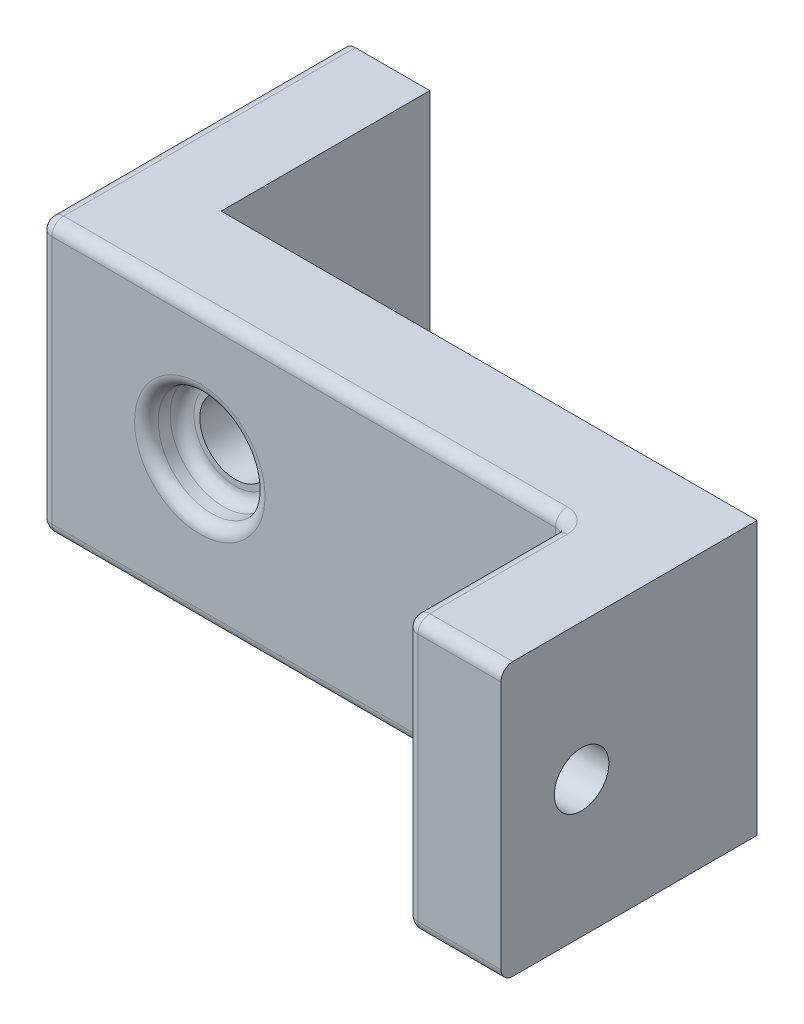
ISO-10303-21;
HEADER;
FILE_DESCRIPTION(('STEP AP214'),'2;1');
FILE_NAME('part.step','',(''),(''),'','','');
FILE_SCHEMA(('AUTOMOTIVE_DESIGN { 1 0 10303 214 1 1 1 1 }'));
ENDSEC;
DATA;
#1=APPLICATION_CONTEXT('core data for automotive mechanical design processes');
#2=APPLICATION_PROTOCOL_DEFINITION('international standard','automotive_design',2000,#1);
#3=PRODUCT_CONTEXT('',#1,'mechanical');
#4=PRODUCT('Part','Part','',(#3));
#5=PRODUCT_RELATED_PRODUCT_CATEGORY('part','',(#4));
#6=PRODUCT_DEFINITION_FORMATION('','',#4);
#7=PRODUCT_DEFINITION_CONTEXT('part definition',#1,'design');
#8=PRODUCT_DEFINITION('design','',#6,#7);
#9=PRODUCT_DEFINITION_SHAPE('','',#8);
#10=(LENGTH_UNIT() NAMED_UNIT(*) SI_UNIT(.MILLI.,.METRE.));
#11=(NAMED_UNIT(*) PLANE_ANGLE_UNIT() SI_UNIT($,.RADIAN.));
#12=(NAMED_UNIT(*) SI_UNIT($,.STERADIAN.) SOLID_ANGLE_UNIT());
#13=UNCERTAINTY_MEASURE_WITH_UNIT(LENGTH_MEASURE(1.E-05),#10,'distance_accuracy_value','');
#14=(GEOMETRIC_REPRESENTATION_CONTEXT(3) GLOBAL_UNCERTAINTY_ASSIGNED_CONTEXT((#13)) GLOBAL_UNIT_ASSIGNED_CONTEXT((#10,
#11,#12)) REPRESENTATION_CONTEXT('',''));
#15=CARTESIAN_POINT('',(0.,0.,0.));
#16=DIRECTION('',(0.,0.,1.));
#17=DIRECTION('',(1.,0.,0.));
#18=AXIS2_PLACEMENT_3D('',#15,#16,#17);
#19=CARTESIAN_POINT('',(6.74,6.,-4.5));
#20=DIRECTION('',(0.,0.,1.));
#21=DIRECTION('',(1.,0.,0.));
#22=AXIS2_PLACEMENT_3D('',#19,#20,#21);
#23=CYLINDRICAL_SURFACE('',#22,1.5);
#24=CARTESIAN_POINT('',(6.74,6.,-4.));
#25=DIRECTION('',(0.,0.,1.));
#26=DIRECTION('',(1.,0.,0.));
#27=AXIS2_PLACEMENT_3D('',#24,#25,#26);
#28=CIRCLE('',#27,1.5);
#29=CARTESIAN_POINT('',(8.24000000000001,6.,-4.));
#30=VERTEX_POINT('',#29);
#31=EDGE_CURVE('E193',#30,#30,#28,.T.);
#32=ORIENTED_EDGE('',*,*,#31,.F.);
#33=EDGE_LOOP('',(#32));
#34=FACE_BOUND('',#33,.T.);
#35=CARTESIAN_POINT('',(6.74,6.,-1.5));
#36=DIRECTION('',(0.,0.,1.));
#37=DIRECTION('',(1.,0.,0.));
#38=AXIS2_PLACEMENT_3D('',#35,#36,#37);
#39=CIRCLE('',#38,1.5);
#40=CARTESIAN_POINT('',(8.24000000000001,6.,-1.5));
#41=VERTEX_POINT('',#40);
#42=EDGE_CURVE('E209',#41,#41,#39,.F.);
#43=ORIENTED_EDGE('',*,*,#42,.F.);
#44=EDGE_LOOP('',(#43));
#45=FACE_BOUND('',#44,.T.);
#46=ADVANCED_FACE('F35',(#34,#45),#23,.F.);
#47=CARTESIAN_POINT('',(22.24,11.5,0.));
#48=DIRECTION('',(0.,0.,-1.));
#49=DIRECTION('',(-1.,0.,0.));
#50=AXIS2_PLACEMENT_3D('',#47,#48,#49);
#51=PLANE('',#50);
#52=DIRECTION('',(0.,-1.,0.));
#53=VECTOR('',#52,1.);
#54=CARTESIAN_POINT('',(0.5,11.5,0.));
#55=LINE('',#54,#53);
#56=CARTESIAN_POINT('',(0.5,11.,0.));
#57=VERTEX_POINT('',#56);
#58=CARTESIAN_POINT('',(0.5,0.5,0.));
#59=VERTEX_POINT('',#58);
#60=EDGE_CURVE('E44',#57,#59,#55,.T.);
#61=ORIENTED_EDGE('',*,*,#60,.T.);
#62=DIRECTION('',(1.,0.,0.));
#63=VECTOR('',#62,1.);
#64=CARTESIAN_POINT('',(22.24,0.5,0.));
#65=LINE('',#64,#63);
#66=CARTESIAN_POINT('',(21.74,0.5,0.));
#67=VERTEX_POINT('',#66);
#68=EDGE_CURVE('E11',#59,#67,#65,.T.);
#69=ORIENTED_EDGE('',*,*,#68,.T.);
#70=DIRECTION('',(0.,-1.,0.));
#71=VECTOR('',#70,1.);
#72=CARTESIAN_POINT('',(21.74,11.5,0.));
#73=LINE('',#72,#71);
#74=CARTESIAN_POINT('',(21.74,11.,0.));
#75=VERTEX_POINT('',#74);
#76=EDGE_CURVE('E289',#67,#75,#73,.F.);
#77=ORIENTED_EDGE('',*,*,#76,.T.);
#78=DIRECTION('',(1.,0.,0.));
#79=VECTOR('',#78,1.);
#80=CARTESIAN_POINT('',(22.24,11.,0.));
#81=LINE('',#80,#79);
#82=EDGE_CURVE('E287',#75,#57,#81,.F.);
#83=ORIENTED_EDGE('',*,*,#82,.T.);
#84=EDGE_LOOP('',(#61,#69,#77,#83));
#85=FACE_BOUND('',#84,.T.);
#86=CARTESIAN_POINT('',(6.74,6.,0.));
#87=DIRECTION('',(0.,0.,-1.));
#88=DIRECTION('',(-1.,0.,0.));
#89=AXIS2_PLACEMENT_3D('',#86,#87,#88);
#90=CIRCLE('',#89,2.75);
#91=CARTESIAN_POINT('',(3.99,6.,0.));
#92=VERTEX_POINT('',#91);
#93=EDGE_CURVE('E221',#92,#92,#90,.T.);
#94=ORIENTED_EDGE('',*,*,#93,.T.);
#95=EDGE_LOOP('',(#94));
#96=FACE_BOUND('',#95,.T.);
#97=ADVANCED_FACE('F368',(#85,#96),#51,.F.);
#98=CARTESIAN_POINT('',(22.24,11.5,6.8));
#99=DIRECTION('',(1.,0.,0.));
#100=DIRECTION('',(0.,0.,-1.));
#101=AXIS2_PLACEMENT_3D('',#98,#99,#100);
#102=PLANE('',#101);
#103=DIRECTION('',(0.,-1.,0.));
#104=VECTOR('',#103,1.);
#105=CARTESIAN_POINT('',(22.24,0.,0.5));
#106=LINE('',#105,#104);
#107=CARTESIAN_POINT('',(22.24,11.,0.5));
#108=VERTEX_POINT('',#107);
#109=CARTESIAN_POINT('',(22.24,0.5,0.5));
#110=VERTEX_POINT('',#109);
#111=EDGE_CURVE('E240',#108,#110,#106,.T.);
#112=ORIENTED_EDGE('',*,*,#111,.T.);
#113=DIRECTION('',(0.,0.,1.));
#114=VECTOR('',#113,1.);
#115=CARTESIAN_POINT('',(22.24,0.5,6.8));
#116=LINE('',#115,#114);
#117=CARTESIAN_POINT('',(22.24,0.5,6.3));
#118=VERTEX_POINT('',#117);
#119=EDGE_CURVE('E242',#110,#118,#116,.T.);
#120=ORIENTED_EDGE('',*,*,#119,.T.);
#121=DIRECTION('',(0.,-1.,0.));
#122=VECTOR('',#121,1.);
#123=CARTESIAN_POINT('',(22.24,11.5,6.3));
#124=LINE('',#123,#122);
#125=CARTESIAN_POINT('',(22.24,11.,6.3));
#126=VERTEX_POINT('',#125);
#127=EDGE_CURVE('E238',#118,#126,#124,.F.);
#128=ORIENTED_EDGE('',*,*,#127,.T.);
#129=DIRECTION('',(0.,0.,1.));
#130=VECTOR('',#129,1.);
#131=CARTESIAN_POINT('',(22.24,11.,6.8));
#132=LINE('',#131,#130);
#133=EDGE_CURVE('E236',#126,#108,#132,.F.);
#134=ORIENTED_EDGE('',*,*,#133,.T.);
#135=EDGE_LOOP('',(#112,#120,#128,#134));
#136=FACE_BOUND('',#135,.T.);
#137=CARTESIAN_POINT('',(22.24,5.75,3.4));
#138=DIRECTION('',(1.,0.,0.));
#139=DIRECTION('',(0.,0.,-1.));
#140=AXIS2_PLACEMENT_3D('',#137,#138,#139);
#141=CIRCLE('',#140,2.65);
#142=CARTESIAN_POINT('',(22.24,5.75,0.75));
#143=VERTEX_POINT('',#142);
#144=EDGE_CURVE('E230',#143,#143,#141,.T.);
#145=ORIENTED_EDGE('',*,*,#144,.T.);
#146=EDGE_LOOP('',(#145));
#147=FACE_BOUND('',#146,.T.);
#148=ADVANCED_FACE('F374',(#136,#147),#102,.F.);
#149=CARTESIAN_POINT('',(26.24,11.5,6.8));
#150=DIRECTION('',(0.,0.,-1.));
#151=DIRECTION('',(-1.,0.,0.));
#152=AXIS2_PLACEMENT_3D('',#149,#150,#151);
#153=PLANE('',#152);
#154=DIRECTION('',(0.,-1.,0.));
#155=VECTOR('',#154,1.);
#156=CARTESIAN_POINT('',(22.74,11.5,6.8));
#157=LINE('',#156,#155);
#158=CARTESIAN_POINT('',(22.74,11.,6.8));
#159=VERTEX_POINT('',#158);
#160=CARTESIAN_POINT('',(22.74,0.5,6.8));
#161=VERTEX_POINT('',#160);
#162=EDGE_CURVE('E257',#159,#161,#157,.T.);
#163=ORIENTED_EDGE('',*,*,#162,.T.);
#164=DIRECTION('',(1.,0.,0.));
#165=VECTOR('',#164,1.);
#166=CARTESIAN_POINT('',(26.24,0.5,6.8));
#167=LINE('',#166,#165);
#168=CARTESIAN_POINT('',(26.24,0.5,6.8));
#169=VERTEX_POINT('',#168);
#170=EDGE_CURVE('E261',#161,#169,#167,.T.);
#171=ORIENTED_EDGE('',*,*,#170,.T.);
#172=DIRECTION('',(0.,-1.,0.));
#173=VECTOR('',#172,1.);
#174=CARTESIAN_POINT('',(26.24,11.5,6.8));
#175=LINE('',#174,#173);
#176=CARTESIAN_POINT('',(26.24,11.,6.8));
#177=VERTEX_POINT('',#176);
#178=EDGE_CURVE('E176',#177,#169,#175,.T.);
#179=ORIENTED_EDGE('',*,*,#178,.F.);
#180=DIRECTION('',(1.,0.,0.));
#181=VECTOR('',#180,1.);
#182=CARTESIAN_POINT('',(26.24,11.,6.8));
#183=LINE('',#182,#181);
#184=EDGE_CURVE('E259',#177,#159,#183,.F.);
#185=ORIENTED_EDGE('',*,*,#184,.T.);
#186=EDGE_LOOP('',(#163,#171,#179,#185));
#187=FACE_BOUND('',#186,.T.);
#188=ADVANCED_FACE('F406',(#187),#153,.F.);
#189=CARTESIAN_POINT('',(26.24,11.5,-4.));
#190=DIRECTION('',(-1.,0.,0.));
#191=DIRECTION('',(0.,0.,1.));
#192=AXIS2_PLACEMENT_3D('',#189,#190,#191);
#193=PLANE('',#192);
#194=CARTESIAN_POINT('',(26.24,5.75,3.4));
#195=DIRECTION('',(-1.,0.,0.));
#196=DIRECTION('',(0.,0.,1.));
#197=AXIS2_PLACEMENT_3D('',#194,#195,#196);
#198=CIRCLE('',#197,1.15);
#199=CARTESIAN_POINT('',(26.24,5.75,4.55));
#200=VERTEX_POINT('',#199);
#201=EDGE_CURVE('E212',#200,#200,#198,.T.);
#202=ORIENTED_EDGE('',*,*,#201,.T.);
#203=EDGE_LOOP('',(#202));
#204=FACE_BOUND('',#203,.T.);
#205=ORIENTED_EDGE('',*,*,#178,.T.);
#206=CARTESIAN_POINT('',(26.24,0.5,6.3));
#207=DIRECTION('',(-1.,0.,0.));
#208=DIRECTION('',(0.,0.,1.));
#209=AXIS2_PLACEMENT_3D('',#206,#207,#208);
#210=CIRCLE('',#209,0.5);
#211=CARTESIAN_POINT('',(26.24,0.,6.3));
#212=VERTEX_POINT('',#211);
#213=EDGE_CURVE('E265',#169,#212,#210,.F.);
#214=ORIENTED_EDGE('',*,*,#213,.T.);
#215=DIRECTION('',(0.,0.,-1.));
#216=VECTOR('',#215,1.);
#217=CARTESIAN_POINT('',(26.24,0.,-4.));
#218=LINE('',#217,#216);
#219=CARTESIAN_POINT('',(26.24,0.,-4.));
#220=VERTEX_POINT('',#219);
#221=EDGE_CURVE('E173',#212,#220,#218,.T.);
#222=ORIENTED_EDGE('',*,*,#221,.T.);
#223=DIRECTION('',(0.,-1.,0.));
#224=VECTOR('',#223,1.);
#225=CARTESIAN_POINT('',(26.24,11.5,-4.));
#226=LINE('',#225,#224);
#227=CARTESIAN_POINT('',(26.24,11.5,-4.));
#228=VERTEX_POINT('',#227);
#229=EDGE_CURVE('E169',#228,#220,#226,.T.);
#230=ORIENTED_EDGE('',*,*,#229,.F.);
#231=DIRECTION('',(0.,0.,-1.));
#232=VECTOR('',#231,1.);
#233=CARTESIAN_POINT('',(26.24,11.5,-4.));
#234=LINE('',#233,#232);
#235=CARTESIAN_POINT('',(26.24,11.5,6.3));
#236=VERTEX_POINT('',#235);
#237=EDGE_CURVE('E156',#236,#228,#234,.T.);
#238=ORIENTED_EDGE('',*,*,#237,.F.);
#239=CARTESIAN_POINT('',(26.24,11.,6.3));
#240=DIRECTION('',(-1.,0.,0.));
#241=DIRECTION('',(0.,0.,1.));
#242=AXIS2_PLACEMENT_3D('',#239,#240,#241);
#243=CIRCLE('',#242,0.5);
#244=EDGE_CURVE('E263',#236,#177,#243,.F.);
#245=ORIENTED_EDGE('',*,*,#244,.T.);
#246=EDGE_LOOP('',(#205,#214,#222,#230,#238,#245));
#247=FACE_BOUND('',#246,.T.);
#248=ADVANCED_FACE('F171',(#204,#247),#193,.F.);
#249=CARTESIAN_POINT('',(3.64,11.5,-4.));
#250=DIRECTION('',(0.,0.,1.));
#251=DIRECTION('',(1.,0.,0.));
#252=AXIS2_PLACEMENT_3D('',#249,#250,#251);
#253=PLANE('',#252);
#254=ORIENTED_EDGE('',*,*,#31,.T.);
#255=EDGE_LOOP('',(#254));
#256=FACE_BOUND('',#255,.T.);
#257=DIRECTION('',(-1.,0.,0.));
#258=VECTOR('',#257,1.);
#259=CARTESIAN_POINT('',(3.64,0.,-4.));
#260=LINE('',#259,#258);
#261=CARTESIAN_POINT('',(3.64,0.,-4.));
#262=VERTEX_POINT('',#261);
#263=EDGE_CURVE('E192',#220,#262,#260,.T.);
#264=ORIENTED_EDGE('',*,*,#263,.T.);
#265=DIRECTION('',(0.,-1.,0.));
#266=VECTOR('',#265,1.);
#267=CARTESIAN_POINT('',(3.64,11.5,-4.));
#268=LINE('',#267,#266);
#269=CARTESIAN_POINT('',(3.64,11.5,-4.));
#270=VERTEX_POINT('',#269);
#271=EDGE_CURVE('E177',#270,#262,#268,.T.);
#272=ORIENTED_EDGE('',*,*,#271,.F.);
#273=DIRECTION('',(-1.,0.,0.));
#274=VECTOR('',#273,1.);
#275=CARTESIAN_POINT('',(3.64,11.5,-4.));
#276=LINE('',#275,#274);
#277=EDGE_CURVE('E160',#228,#270,#276,.T.);
#278=ORIENTED_EDGE('',*,*,#277,.F.);
#279=ORIENTED_EDGE('',*,*,#229,.T.);
#280=EDGE_LOOP('',(#264,#272,#278,#279));
#281=FACE_BOUND('',#280,.T.);
#282=ADVANCED_FACE('F179',(#256,#281),#253,.F.);
#283=CARTESIAN_POINT('',(3.64,11.5,-12.8));
#284=DIRECTION('',(-1.,0.,0.));
#285=DIRECTION('',(0.,0.,1.));
#286=AXIS2_PLACEMENT_3D('',#283,#284,#285);
#287=PLANE('',#286);
#288=DIRECTION('',(0.,0.,-1.));
#289=VECTOR('',#288,1.);
#290=CARTESIAN_POINT('',(3.64,0.,-12.8));
#291=LINE('',#290,#289);
#292=CARTESIAN_POINT('',(3.64,0.,-12.8));
#293=VERTEX_POINT('',#292);
#294=EDGE_CURVE('E195',#262,#293,#291,.T.);
#295=ORIENTED_EDGE('',*,*,#294,.T.);
#296=DIRECTION('',(0.,-1.,0.));
#297=VECTOR('',#296,1.);
#298=CARTESIAN_POINT('',(3.64,11.5,-12.8));
#299=LINE('',#298,#297);
#300=CARTESIAN_POINT('',(3.64,11.5,-12.8));
#301=VERTEX_POINT('',#300);
#302=EDGE_CURVE('E201',#301,#293,#299,.T.);
#303=ORIENTED_EDGE('',*,*,#302,.F.);
#304=DIRECTION('',(0.,0.,-1.));
#305=VECTOR('',#304,1.);
#306=CARTESIAN_POINT('',(3.64,11.5,-12.8));
#307=LINE('',#306,#305);
#308=EDGE_CURVE('E182',#270,#301,#307,.T.);
#309=ORIENTED_EDGE('',*,*,#308,.F.);
#310=ORIENTED_EDGE('',*,*,#271,.T.);
#311=EDGE_LOOP('',(#295,#303,#309,#310));
#312=FACE_BOUND('',#311,.T.);
#313=ADVANCED_FACE('F396',(#312),#287,.F.);
#314=CARTESIAN_POINT('',(0.,11.5,-12.8));
#315=DIRECTION('',(0.,0.,1.));
#316=DIRECTION('',(1.,0.,0.));
#317=AXIS2_PLACEMENT_3D('',#314,#315,#316);
#318=PLANE('',#317);
#319=DIRECTION('',(0.,-1.,0.));
#320=VECTOR('',#319,1.);
#321=CARTESIAN_POINT('',(0.,11.5,-12.8));
#322=LINE('',#321,#320);
#323=CARTESIAN_POINT('',(0.,11.,-12.8));
#324=VERTEX_POINT('',#323);
#325=CARTESIAN_POINT('',(0.,0.5,-12.8));
#326=VERTEX_POINT('',#325);
#327=EDGE_CURVE('E190',#324,#326,#322,.T.);
#328=ORIENTED_EDGE('',*,*,#327,.F.);
#329=CARTESIAN_POINT('',(0.5,11.,-12.8));
#330=DIRECTION('',(0.,0.,1.));
#331=DIRECTION('',(1.,0.,0.));
#332=AXIS2_PLACEMENT_3D('',#329,#330,#331);
#333=CIRCLE('',#332,0.5);
#334=CARTESIAN_POINT('',(0.5,11.5,-12.8));
#335=VERTEX_POINT('',#334);
#336=EDGE_CURVE('E285',#324,#335,#333,.F.);
#337=ORIENTED_EDGE('',*,*,#336,.T.);
#338=DIRECTION('',(-1.,0.,0.));
#339=VECTOR('',#338,1.);
#340=CARTESIAN_POINT('',(0.,11.5,-12.8));
#341=LINE('',#340,#339);
#342=EDGE_CURVE('E184',#301,#335,#341,.T.);
#343=ORIENTED_EDGE('',*,*,#342,.F.);
#344=ORIENTED_EDGE('',*,*,#302,.T.);
#345=DIRECTION('',(-1.,0.,0.));
#346=VECTOR('',#345,1.);
#347=CARTESIAN_POINT('',(0.,0.,-12.8));
#348=LINE('',#347,#346);
#349=CARTESIAN_POINT('',(0.5,0.,-12.8));
#350=VERTEX_POINT('',#349);
#351=EDGE_CURVE('E166',#293,#350,#348,.T.);
#352=ORIENTED_EDGE('',*,*,#351,.T.);
#353=CARTESIAN_POINT('',(0.5,0.5,-12.8));
#354=DIRECTION('',(0.,0.,1.));
#355=DIRECTION('',(1.,0.,0.));
#356=AXIS2_PLACEMENT_3D('',#353,#354,#355);
#357=CIRCLE('',#356,0.5);
#358=EDGE_CURVE('E283',#350,#326,#357,.F.);
#359=ORIENTED_EDGE('',*,*,#358,.T.);
#360=EDGE_LOOP('',(#328,#337,#343,#344,#352,#359));
#361=FACE_BOUND('',#360,.T.);
#362=ADVANCED_FACE('F392',(#361),#318,.F.);
#363=CARTESIAN_POINT('',(0.,11.5,0.));
#364=DIRECTION('',(1.,0.,0.));
#365=DIRECTION('',(0.,0.,-1.));
#366=AXIS2_PLACEMENT_3D('',#363,#364,#365);
#367=PLANE('',#366);
#368=DIRECTION('',(0.,-1.,0.));
#369=VECTOR('',#368,1.);
#370=CARTESIAN_POINT('',(0.,11.5,-0.5));
#371=LINE('',#370,#369);
#372=CARTESIAN_POINT('',(0.,0.5,-0.5));
#373=VERTEX_POINT('',#372);
#374=CARTESIAN_POINT('',(0.,11.,-0.5));
#375=VERTEX_POINT('',#374);
#376=EDGE_CURVE('E277',#373,#375,#371,.F.);
#377=ORIENTED_EDGE('',*,*,#376,.T.);
#378=DIRECTION('',(0.,0.,1.));
#379=VECTOR('',#378,1.);
#380=CARTESIAN_POINT('',(0.,11.,0.));
#381=LINE('',#380,#379);
#382=EDGE_CURVE('E281',#375,#324,#381,.F.);
#383=ORIENTED_EDGE('',*,*,#382,.T.);
#384=ORIENTED_EDGE('',*,*,#327,.T.);
#385=DIRECTION('',(0.,0.,1.));
#386=VECTOR('',#385,1.);
#387=CARTESIAN_POINT('',(0.,0.5,0.));
#388=LINE('',#387,#386);
#389=EDGE_CURVE('E279',#326,#373,#388,.T.);
#390=ORIENTED_EDGE('',*,*,#389,.T.);
#391=EDGE_LOOP('',(#377,#383,#384,#390));
#392=FACE_BOUND('',#391,.T.);
#393=ADVANCED_FACE('F385',(#392),#367,.F.);
#394=CARTESIAN_POINT('',(0.,11.5,0.));
#395=DIRECTION('',(0.,-1.,0.));
#396=DIRECTION('',(0.,0.,-1.));
#397=AXIS2_PLACEMENT_3D('',#394,#395,#396);
#398=PLANE('',#397);
#399=DIRECTION('',(0.,0.,1.));
#400=VECTOR('',#399,1.);
#401=CARTESIAN_POINT('',(22.74,11.5,0.));
#402=LINE('',#401,#400);
#403=CARTESIAN_POINT('',(22.74,11.5,0.5));
#404=VERTEX_POINT('',#403);
#405=CARTESIAN_POINT('',(22.74,11.5,6.3));
#406=VERTEX_POINT('',#405);
#407=EDGE_CURVE('E267',#404,#406,#402,.T.);
#408=ORIENTED_EDGE('',*,*,#407,.T.);
#409=DIRECTION('',(1.,0.,0.));
#410=VECTOR('',#409,1.);
#411=CARTESIAN_POINT('',(0.,11.5,6.3));
#412=LINE('',#411,#410);
#413=EDGE_CURVE('E163',#406,#236,#412,.T.);
#414=ORIENTED_EDGE('',*,*,#413,.T.);
#415=ORIENTED_EDGE('',*,*,#237,.T.);
#416=ORIENTED_EDGE('',*,*,#277,.T.);
#417=ORIENTED_EDGE('',*,*,#308,.T.);
#418=ORIENTED_EDGE('',*,*,#342,.T.);
#419=DIRECTION('',(0.,0.,1.));
#420=VECTOR('',#419,1.);
#421=CARTESIAN_POINT('',(0.5,11.5,0.));
#422=LINE('',#421,#420);
#423=CARTESIAN_POINT('',(0.5,11.5,-0.5));
#424=VERTEX_POINT('',#423);
#425=EDGE_CURVE('E274',#335,#424,#422,.T.);
#426=ORIENTED_EDGE('',*,*,#425,.T.);
#427=DIRECTION('',(1.,0.,0.));
#428=VECTOR('',#427,1.);
#429=CARTESIAN_POINT('',(0.,11.5,-0.5));
#430=LINE('',#429,#428);
#431=CARTESIAN_POINT('',(21.74,11.5,-0.500000000000001));
#432=VERTEX_POINT('',#431);
#433=EDGE_CURVE('E272',#424,#432,#430,.T.);
#434=ORIENTED_EDGE('',*,*,#433,.T.);
#435=CARTESIAN_POINT('',(21.74,11.5,0.5));
#436=DIRECTION('',(0.,-1.,0.));
#437=DIRECTION('',(0.,0.,-1.));
#438=AXIS2_PLACEMENT_3D('',#435,#436,#437);
#439=CIRCLE('',#438,1.);
#440=EDGE_CURVE('E269',#404,#432,#439,.F.);
#441=ORIENTED_EDGE('',*,*,#440,.F.);
#442=EDGE_LOOP('',(#408,#414,#415,#416,#417,#418,#426,#434,#441));
#443=FACE_BOUND('',#442,.T.);
#444=ADVANCED_FACE('F158',(#443),#398,.F.);
#445=CARTESIAN_POINT('',(0.,0.,0.));
#446=DIRECTION('',(0.,-1.,0.));
#447=DIRECTION('',(0.,0.,-1.));
#448=AXIS2_PLACEMENT_3D('',#445,#446,#447);
#449=PLANE('',#448);
#450=ORIENTED_EDGE('',*,*,#221,.F.);
#451=DIRECTION('',(1.,0.,0.));
#452=VECTOR('',#451,1.);
#453=CARTESIAN_POINT('',(22.24,0.,6.3));
#454=LINE('',#453,#452);
#455=CARTESIAN_POINT('',(22.74,0.,6.3));
#456=VERTEX_POINT('',#455);
#457=EDGE_CURVE('E255',#212,#456,#454,.F.);
#458=ORIENTED_EDGE('',*,*,#457,.T.);
#459=DIRECTION('',(0.,0.,1.));
#460=VECTOR('',#459,1.);
#461=CARTESIAN_POINT('',(22.74,0.,0.));
#462=LINE('',#461,#460);
#463=CARTESIAN_POINT('',(22.74,0.,0.5));
#464=VERTEX_POINT('',#463);
#465=EDGE_CURVE('E252',#456,#464,#462,.F.);
#466=ORIENTED_EDGE('',*,*,#465,.T.);
#467=CARTESIAN_POINT('',(21.74,0.,0.5));
#468=DIRECTION('',(0.,-1.,0.));
#469=DIRECTION('',(0.,0.,-1.));
#470=AXIS2_PLACEMENT_3D('',#467,#468,#469);
#471=CIRCLE('',#470,1.);
#472=CARTESIAN_POINT('',(21.74,0.,-0.500000000000001));
#473=VERTEX_POINT('',#472);
#474=EDGE_CURVE('E249',#473,#464,#471,.T.);
#475=ORIENTED_EDGE('',*,*,#474,.F.);
#476=DIRECTION('',(1.,0.,0.));
#477=VECTOR('',#476,1.);
#478=CARTESIAN_POINT('',(0.,0.,-0.5));
#479=LINE('',#478,#477);
#480=CARTESIAN_POINT('',(0.5,0.,-0.5));
#481=VERTEX_POINT('',#480);
#482=EDGE_CURVE('E245',#473,#481,#479,.F.);
#483=ORIENTED_EDGE('',*,*,#482,.T.);
#484=DIRECTION('',(0.,0.,1.));
#485=VECTOR('',#484,1.);
#486=CARTESIAN_POINT('',(0.5,0.,-12.8));
#487=LINE('',#486,#485);
#488=EDGE_CURVE('E247',#481,#350,#487,.F.);
#489=ORIENTED_EDGE('',*,*,#488,.T.);
#490=ORIENTED_EDGE('',*,*,#351,.F.);
#491=ORIENTED_EDGE('',*,*,#294,.F.);
#492=ORIENTED_EDGE('',*,*,#263,.F.);
#493=EDGE_LOOP('',(#450,#458,#466,#475,#483,#489,#490,#491,#492));
#494=FACE_BOUND('',#493,.T.);
#495=ADVANCED_FACE('F384',(#494),#449,.T.);
#496=CARTESIAN_POINT('',(6.74,6.,-1.5));
#497=DIRECTION('',(0.,0.,1.));
#498=DIRECTION('',(1.,0.,0.));
#499=AXIS2_PLACEMENT_3D('',#496,#497,#498);
#500=PLANE('',#499);
#501=CARTESIAN_POINT('',(6.74,6.,-1.5));
#502=DIRECTION('',(0.,0.,1.));
#503=DIRECTION('',(1.,0.,0.));
#504=AXIS2_PLACEMENT_3D('',#501,#502,#503);
#505=CIRCLE('',#504,1.75);
#506=CARTESIAN_POINT('',(8.49,6.,-1.5));
#507=VERTEX_POINT('',#506);
#508=EDGE_CURVE('E206',#507,#507,#505,.T.);
#509=ORIENTED_EDGE('',*,*,#508,.T.);
#510=EDGE_LOOP('',(#509));
#511=FACE_BOUND('',#510,.T.);
#512=ORIENTED_EDGE('',*,*,#42,.T.);
#513=EDGE_LOOP('',(#512));
#514=FACE_BOUND('',#513,.T.);
#515=ADVANCED_FACE('F388',(#511,#514),#500,.T.);
#516=CARTESIAN_POINT('',(6.74,6.,-1.5));
#517=DIRECTION('',(0.,0.,1.));
#518=DIRECTION('',(1.,0.,0.));
#519=AXIS2_PLACEMENT_3D('',#516,#517,#518);
#520=CYLINDRICAL_SURFACE('',#519,2.25);
#521=CARTESIAN_POINT('',(6.74,6.,-0.999999999999997));
#522=DIRECTION('',(0.,0.,1.));
#523=DIRECTION('',(1.,0.,0.));
#524=AXIS2_PLACEMENT_3D('',#521,#522,#523);
#525=CIRCLE('',#524,2.25);
#526=CARTESIAN_POINT('',(8.99,6.,-0.999999999999997));
#527=VERTEX_POINT('',#526);
#528=EDGE_CURVE('E218',#527,#527,#525,.F.);
#529=ORIENTED_EDGE('',*,*,#528,.T.);
#530=EDGE_LOOP('',(#529));
#531=FACE_BOUND('',#530,.T.);
#532=CARTESIAN_POINT('',(6.74,6.,-0.5));
#533=DIRECTION('',(0.,0.,-1.));
#534=DIRECTION('',(-1.,0.,0.));
#535=AXIS2_PLACEMENT_3D('',#532,#533,#534);
#536=CIRCLE('',#535,2.25);
#537=CARTESIAN_POINT('',(4.49,6.,-0.5));
#538=VERTEX_POINT('',#537);
#539=EDGE_CURVE('E215',#538,#538,#536,.F.);
#540=ORIENTED_EDGE('',*,*,#539,.T.);
#541=EDGE_LOOP('',(#540));
#542=FACE_BOUND('',#541,.T.);
#543=ADVANCED_FACE('F380',(#531,#542),#520,.F.);
#544=CARTESIAN_POINT('',(23.99,5.75,3.4));
#545=DIRECTION('',(-1.,0.,0.));
#546=DIRECTION('',(0.,0.,1.));
#547=AXIS2_PLACEMENT_3D('',#544,#545,#546);
#548=CYLINDRICAL_SURFACE('',#547,2.15);
#549=CARTESIAN_POINT('',(22.74,5.75,3.4));
#550=DIRECTION('',(1.,0.,0.));
#551=DIRECTION('',(0.,0.,-1.));
#552=AXIS2_PLACEMENT_3D('',#549,#550,#551);
#553=CIRCLE('',#552,2.15);
#554=CARTESIAN_POINT('',(22.74,5.75,1.25));
#555=VERTEX_POINT('',#554);
#556=EDGE_CURVE('E227',#555,#555,#553,.F.);
#557=ORIENTED_EDGE('',*,*,#556,.T.);
#558=EDGE_LOOP('',(#557));
#559=FACE_BOUND('',#558,.T.);
#560=CARTESIAN_POINT('',(23.49,5.75,3.4));
#561=DIRECTION('',(-1.,0.,0.));
#562=DIRECTION('',(0.,0.,1.));
#563=AXIS2_PLACEMENT_3D('',#560,#561,#562);
#564=CIRCLE('',#563,2.15);
#565=CARTESIAN_POINT('',(23.49,5.75,5.55));
#566=VERTEX_POINT('',#565);
#567=EDGE_CURVE('E224',#566,#566,#564,.F.);
#568=ORIENTED_EDGE('',*,*,#567,.T.);
#569=EDGE_LOOP('',(#568));
#570=FACE_BOUND('',#569,.T.);
#571=ADVANCED_FACE('F364',(#559,#570),#548,.F.);
#572=CARTESIAN_POINT('',(23.99,5.75,3.4));
#573=DIRECTION('',(-1.,0.,0.));
#574=DIRECTION('',(0.,0.,1.));
#575=AXIS2_PLACEMENT_3D('',#572,#573,#574);
#576=PLANE('',#575);
#577=CARTESIAN_POINT('',(23.99,5.75,3.4));
#578=DIRECTION('',(-1.,0.,0.));
#579=DIRECTION('',(0.,0.,1.));
#580=AXIS2_PLACEMENT_3D('',#577,#578,#579);
#581=CIRCLE('',#580,1.65);
#582=CARTESIAN_POINT('',(23.99,5.75,5.05));
#583=VERTEX_POINT('',#582);
#584=EDGE_CURVE('E233',#583,#583,#581,.T.);
#585=ORIENTED_EDGE('',*,*,#584,.T.);
#586=EDGE_LOOP('',(#585));
#587=FACE_BOUND('',#586,.T.);
#588=CARTESIAN_POINT('',(23.99,5.75,3.4));
#589=DIRECTION('',(-1.,0.,0.));
#590=DIRECTION('',(0.,0.,1.));
#591=AXIS2_PLACEMENT_3D('',#588,#589,#590);
#592=CIRCLE('',#591,1.15);
#593=CARTESIAN_POINT('',(23.99,5.75,4.55));
#594=VERTEX_POINT('',#593);
#595=EDGE_CURVE('E340',#594,#594,#592,.T.);
#596=ORIENTED_EDGE('',*,*,#595,.F.);
#597=EDGE_LOOP('',(#596));
#598=FACE_BOUND('',#597,.T.);
#599=ADVANCED_FACE('F355',(#587,#598),#576,.T.);
#600=CARTESIAN_POINT('',(26.49,5.75,3.4));
#601=DIRECTION('',(-1.,0.,0.));
#602=DIRECTION('',(0.,0.,1.));
#603=AXIS2_PLACEMENT_3D('',#600,#601,#602);
#604=CYLINDRICAL_SURFACE('',#603,1.15);
#605=ORIENTED_EDGE('',*,*,#595,.T.);
#606=EDGE_LOOP('',(#605));
#607=FACE_BOUND('',#606,.T.);
#608=ORIENTED_EDGE('',*,*,#201,.F.);
#609=EDGE_LOOP('',(#608));
#610=FACE_BOUND('',#609,.T.);
#611=ADVANCED_FACE('F352',(#607,#610),#604,.F.);
#612=CARTESIAN_POINT('',(6.74,6.,-0.999999999999997));
#613=DIRECTION('',(0.,0.,1.));
#614=DIRECTION('',(1.,0.,0.));
#615=AXIS2_PLACEMENT_3D('',#612,#613,#614);
#616=TOROIDAL_SURFACE('',#615,1.75,0.5);
#617=ORIENTED_EDGE('',*,*,#528,.F.);
#618=EDGE_LOOP('',(#617));
#619=FACE_BOUND('',#618,.T.);
#620=ORIENTED_EDGE('',*,*,#508,.F.);
#621=EDGE_LOOP('',(#620));
#622=FACE_BOUND('',#621,.T.);
#623=ADVANCED_FACE('F354',(#619,#622),#616,.F.);
#624=CARTESIAN_POINT('',(6.74,6.,-0.5));
#625=DIRECTION('',(0.,0.,-1.));
#626=DIRECTION('',(-1.,0.,0.));
#627=AXIS2_PLACEMENT_3D('',#624,#625,#626);
#628=TOROIDAL_SURFACE('',#627,2.75,0.5);
#629=ORIENTED_EDGE('',*,*,#93,.F.);
#630=EDGE_LOOP('',(#629));
#631=FACE_BOUND('',#630,.T.);
#632=ORIENTED_EDGE('',*,*,#539,.F.);
#633=EDGE_LOOP('',(#632));
#634=FACE_BOUND('',#633,.T.);
#635=ADVANCED_FACE('F361',(#631,#634),#628,.T.);
#636=CARTESIAN_POINT('',(22.74,5.75,3.4));
#637=DIRECTION('',(1.,0.,0.));
#638=DIRECTION('',(0.,0.,-1.));
#639=AXIS2_PLACEMENT_3D('',#636,#637,#638);
#640=TOROIDAL_SURFACE('',#639,2.65,0.5);
#641=ORIENTED_EDGE('',*,*,#144,.F.);
#642=EDGE_LOOP('',(#641));
#643=FACE_BOUND('',#642,.T.);
#644=ORIENTED_EDGE('',*,*,#556,.F.);
#645=EDGE_LOOP('',(#644));
#646=FACE_BOUND('',#645,.T.);
#647=ADVANCED_FACE('F415',(#643,#646),#640,.T.);
#648=CARTESIAN_POINT('',(23.49,5.75,3.4));
#649=DIRECTION('',(-1.,0.,0.));
#650=DIRECTION('',(0.,0.,1.));
#651=AXIS2_PLACEMENT_3D('',#648,#649,#650);
#652=TOROIDAL_SURFACE('',#651,1.65,0.5);
#653=ORIENTED_EDGE('',*,*,#567,.F.);
#654=EDGE_LOOP('',(#653));
#655=FACE_BOUND('',#654,.T.);
#656=ORIENTED_EDGE('',*,*,#584,.F.);
#657=EDGE_LOOP('',(#656));
#658=FACE_BOUND('',#657,.T.);
#659=ADVANCED_FACE('F419',(#655,#658),#652,.F.);
#660=CARTESIAN_POINT('',(0.5,11.,0.));
#661=DIRECTION('',(0.,0.,1.));
#662=DIRECTION('',(1.,0.,0.));
#663=AXIS2_PLACEMENT_3D('',#660,#661,#662);
#664=CYLINDRICAL_SURFACE('',#663,0.5);
#665=CARTESIAN_POINT('',(0.5,11.,-0.5));
#666=DIRECTION('',(0.,0.,1.));
#667=DIRECTION('',(1.,0.,0.));
#668=AXIS2_PLACEMENT_3D('',#665,#666,#667);
#669=CIRCLE('',#668,0.5);
#670=EDGE_CURVE('E39',#424,#375,#669,.T.);
#671=ORIENTED_EDGE('',*,*,#670,.F.);
#672=ORIENTED_EDGE('',*,*,#425,.F.);
#673=ORIENTED_EDGE('',*,*,#336,.F.);
#674=ORIENTED_EDGE('',*,*,#382,.F.);
#675=EDGE_LOOP('',(#671,#672,#673,#674));
#676=FACE_BOUND('',#675,.T.);
#677=ADVANCED_FACE('F37',(#676),#664,.T.);
#678=CARTESIAN_POINT('',(0.5,11.,-0.5));
#679=DIRECTION('',(0.,0.,1.));
#680=DIRECTION('',(1.,0.,0.));
#681=AXIS2_PLACEMENT_3D('',#678,#679,#680);
#682=SPHERICAL_SURFACE('',#681,0.5);
#683=CARTESIAN_POINT('',(0.5,11.,-0.5));
#684=DIRECTION('',(-1.,0.,0.));
#685=DIRECTION('',(0.,-1.,0.));
#686=AXIS2_PLACEMENT_3D('',#683,#684,#685);
#687=CIRCLE('',#686,0.5);
#688=EDGE_CURVE('E332',#424,#57,#687,.F.);
#689=ORIENTED_EDGE('',*,*,#688,.F.);
#690=ORIENTED_EDGE('',*,*,#670,.T.);
#691=CARTESIAN_POINT('',(0.5,11.,-0.5));
#692=DIRECTION('',(0.,1.,0.));
#693=DIRECTION('',(0.,0.,1.));
#694=AXIS2_PLACEMENT_3D('',#691,#692,#693);
#695=CIRCLE('',#694,0.5);
#696=EDGE_CURVE('E334',#57,#375,#695,.F.);
#697=ORIENTED_EDGE('',*,*,#696,.F.);
#698=EDGE_LOOP('',(#689,#690,#697));
#699=FACE_BOUND('',#698,.T.);
#700=ADVANCED_FACE('F480',(#699),#682,.T.);
#701=CARTESIAN_POINT('',(0.5,0.5,0.));
#702=DIRECTION('',(0.,0.,-1.));
#703=DIRECTION('',(-1.,0.,0.));
#704=AXIS2_PLACEMENT_3D('',#701,#702,#703);
#705=CYLINDRICAL_SURFACE('',#704,0.5);
#706=ORIENTED_EDGE('',*,*,#358,.F.);
#707=ORIENTED_EDGE('',*,*,#488,.F.);
#708=CARTESIAN_POINT('',(0.5,0.5,-0.5));
#709=DIRECTION('',(0.,0.,1.));
#710=DIRECTION('',(1.,0.,0.));
#711=AXIS2_PLACEMENT_3D('',#708,#709,#710);
#712=CIRCLE('',#711,0.5);
#713=EDGE_CURVE('E329',#373,#481,#712,.T.);
#714=ORIENTED_EDGE('',*,*,#713,.F.);
#715=ORIENTED_EDGE('',*,*,#389,.F.);
#716=EDGE_LOOP('',(#706,#707,#714,#715));
#717=FACE_BOUND('',#716,.T.);
#718=ADVANCED_FACE('F478',(#717),#705,.T.);
#719=CARTESIAN_POINT('',(0.5,11.5,-0.5));
#720=DIRECTION('',(0.,-1.,0.));
#721=DIRECTION('',(0.,0.,-1.));
#722=AXIS2_PLACEMENT_3D('',#719,#720,#721);
#723=CYLINDRICAL_SURFACE('',#722,0.5);
#724=ORIENTED_EDGE('',*,*,#696,.T.);
#725=ORIENTED_EDGE('',*,*,#376,.F.);
#726=CARTESIAN_POINT('',(0.5,0.5,-0.5));
#727=DIRECTION('',(0.,-1.,0.));
#728=DIRECTION('',(0.,0.,-1.));
#729=AXIS2_PLACEMENT_3D('',#726,#727,#728);
#730=CIRCLE('',#729,0.5);
#731=EDGE_CURVE('E326',#59,#373,#730,.T.);
#732=ORIENTED_EDGE('',*,*,#731,.F.);
#733=ORIENTED_EDGE('',*,*,#60,.F.);
#734=EDGE_LOOP('',(#724,#725,#732,#733));
#735=FACE_BOUND('',#734,.T.);
#736=ADVANCED_FACE('F474',(#735),#723,.T.);
#737=CARTESIAN_POINT('',(0.,11.,-0.5));
#738=DIRECTION('',(1.,0.,0.));
#739=DIRECTION('',(0.,0.,-1.));
#740=AXIS2_PLACEMENT_3D('',#737,#738,#739);
#741=CYLINDRICAL_SURFACE('',#740,0.5);
#742=ORIENTED_EDGE('',*,*,#688,.T.);
#743=ORIENTED_EDGE('',*,*,#82,.F.);
#744=CARTESIAN_POINT('',(21.74,11.,-0.500000000000001));
#745=DIRECTION('',(1.,0.,0.));
#746=DIRECTION('',(0.,0.,-1.));
#747=AXIS2_PLACEMENT_3D('',#744,#745,#746);
#748=CIRCLE('',#747,0.5);
#749=EDGE_CURVE('E323',#432,#75,#748,.T.);
#750=ORIENTED_EDGE('',*,*,#749,.F.);
#751=ORIENTED_EDGE('',*,*,#433,.F.);
#752=EDGE_LOOP('',(#742,#743,#750,#751));
#753=FACE_BOUND('',#752,.T.);
#754=ADVANCED_FACE('F470',(#753),#741,.T.);
#755=CARTESIAN_POINT('',(22.74,11.,0.));
#756=DIRECTION('',(0.,0.,1.));
#757=DIRECTION('',(1.,0.,0.));
#758=AXIS2_PLACEMENT_3D('',#755,#756,#757);
#759=CYLINDRICAL_SURFACE('',#758,0.5);
#760=CARTESIAN_POINT('',(22.74,11.,6.3));
#761=DIRECTION('',(0.,0.,1.));
#762=DIRECTION('',(1.,0.,0.));
#763=AXIS2_PLACEMENT_3D('',#760,#761,#762);
#764=CIRCLE('',#763,0.5);
#765=EDGE_CURVE('E317',#406,#126,#764,.T.);
#766=ORIENTED_EDGE('',*,*,#765,.F.);
#767=ORIENTED_EDGE('',*,*,#407,.F.);
#768=CARTESIAN_POINT('',(22.74,11.,0.5));
#769=DIRECTION('',(0.,0.,-1.));
#770=DIRECTION('',(-1.,0.,0.));
#771=AXIS2_PLACEMENT_3D('',#768,#769,#770);
#772=CIRCLE('',#771,0.5);
#773=EDGE_CURVE('E320',#108,#404,#772,.T.);
#774=ORIENTED_EDGE('',*,*,#773,.F.);
#775=ORIENTED_EDGE('',*,*,#133,.F.);
#776=EDGE_LOOP('',(#766,#767,#774,#775));
#777=FACE_BOUND('',#776,.T.);
#778=ADVANCED_FACE('F466',(#777),#759,.T.);
#779=CARTESIAN_POINT('',(0.,11.,6.3));
#780=DIRECTION('',(1.,0.,0.));
#781=DIRECTION('',(0.,0.,-1.));
#782=AXIS2_PLACEMENT_3D('',#779,#780,#781);
#783=CYLINDRICAL_SURFACE('',#782,0.5);
#784=ORIENTED_EDGE('',*,*,#244,.F.);
#785=ORIENTED_EDGE('',*,*,#413,.F.);
#786=CARTESIAN_POINT('',(22.74,11.,6.3));
#787=DIRECTION('',(-1.,0.,0.));
#788=DIRECTION('',(0.,0.,1.));
#789=AXIS2_PLACEMENT_3D('',#786,#787,#788);
#790=CIRCLE('',#789,0.5);
#791=EDGE_CURVE('E314',#159,#406,#790,.T.);
#792=ORIENTED_EDGE('',*,*,#791,.F.);
#793=ORIENTED_EDGE('',*,*,#184,.F.);
#794=EDGE_LOOP('',(#784,#785,#792,#793));
#795=FACE_BOUND('',#794,.T.);
#796=ADVANCED_FACE('F462',(#795),#783,.T.);
#797=CARTESIAN_POINT('',(0.5,0.5,-0.5));
#798=DIRECTION('',(0.,0.,1.));
#799=DIRECTION('',(1.,0.,0.));
#800=AXIS2_PLACEMENT_3D('',#797,#798,#799);
#801=SPHERICAL_SURFACE('',#800,0.5);
#802=ORIENTED_EDGE('',*,*,#731,.T.);
#803=ORIENTED_EDGE('',*,*,#713,.T.);
#804=CARTESIAN_POINT('',(0.5,0.5,-0.5));
#805=DIRECTION('',(-1.,0.,0.));
#806=DIRECTION('',(0.,0.,1.));
#807=AXIS2_PLACEMENT_3D('',#804,#805,#806);
#808=CIRCLE('',#807,0.5);
#809=EDGE_CURVE('E311',#59,#481,#808,.F.);
#810=ORIENTED_EDGE('',*,*,#809,.F.);
#811=EDGE_LOOP('',(#802,#803,#810));
#812=FACE_BOUND('',#811,.T.);
#813=ADVANCED_FACE('F458',(#812),#801,.T.);
#814=CARTESIAN_POINT('',(21.74,11.,0.5));
#815=DIRECTION('',(0.,-1.,0.));
#816=DIRECTION('',(0.,0.,-1.));
#817=AXIS2_PLACEMENT_3D('',#814,#815,#816);
#818=TOROIDAL_SURFACE('',#817,1.,0.5);
#819=ORIENTED_EDGE('',*,*,#440,.T.);
#820=ORIENTED_EDGE('',*,*,#749,.T.);
#821=CARTESIAN_POINT('',(21.74,11.,0.5));
#822=DIRECTION('',(0.,-1.,0.));
#823=DIRECTION('',(0.,0.,-1.));
#824=AXIS2_PLACEMENT_3D('',#821,#822,#823);
#825=CIRCLE('',#824,0.5);
#826=EDGE_CURVE('E308',#108,#75,#825,.F.);
#827=ORIENTED_EDGE('',*,*,#826,.F.);
#828=ORIENTED_EDGE('',*,*,#773,.T.);
#829=EDGE_LOOP('',(#819,#820,#827,#828));
#830=FACE_BOUND('',#829,.T.);
#831=ADVANCED_FACE('F454',(#830),#818,.T.);
#832=CARTESIAN_POINT('',(22.74,11.,6.3));
#833=DIRECTION('',(0.,0.,1.));
#834=DIRECTION('',(1.,0.,0.));
#835=AXIS2_PLACEMENT_3D('',#832,#833,#834);
#836=SPHERICAL_SURFACE('',#835,0.5);
#837=ORIENTED_EDGE('',*,*,#791,.T.);
#838=ORIENTED_EDGE('',*,*,#765,.T.);
#839=CARTESIAN_POINT('',(22.74,11.,6.3));
#840=DIRECTION('',(0.,1.,0.));
#841=DIRECTION('',(0.,0.,1.));
#842=AXIS2_PLACEMENT_3D('',#839,#840,#841);
#843=CIRCLE('',#842,0.5);
#844=EDGE_CURVE('E305',#159,#126,#843,.F.);
#845=ORIENTED_EDGE('',*,*,#844,.F.);
#846=EDGE_LOOP('',(#837,#838,#845));
#847=FACE_BOUND('',#846,.T.);
#848=ADVANCED_FACE('F450',(#847),#836,.T.);
#849=CARTESIAN_POINT('',(22.24,0.5,-0.500000000000001));
#850=DIRECTION('',(-1.,0.,0.));
#851=DIRECTION('',(0.,0.,1.));
#852=AXIS2_PLACEMENT_3D('',#849,#850,#851);
#853=CYLINDRICAL_SURFACE('',#852,0.5);
#854=ORIENTED_EDGE('',*,*,#809,.T.);
#855=ORIENTED_EDGE('',*,*,#482,.F.);
#856=CARTESIAN_POINT('',(21.74,0.5,-0.500000000000001));
#857=DIRECTION('',(1.,0.,0.));
#858=DIRECTION('',(0.,0.,-1.));
#859=AXIS2_PLACEMENT_3D('',#856,#857,#858);
#860=CIRCLE('',#859,0.5);
#861=EDGE_CURVE('E303',#67,#473,#860,.T.);
#862=ORIENTED_EDGE('',*,*,#861,.F.);
#863=ORIENTED_EDGE('',*,*,#68,.F.);
#864=EDGE_LOOP('',(#854,#855,#862,#863));
#865=FACE_BOUND('',#864,.T.);
#866=ADVANCED_FACE('F446',(#865),#853,.T.);
#867=CARTESIAN_POINT('',(21.74,11.5,0.5));
#868=DIRECTION('',(0.,1.,0.));
#869=DIRECTION('',(0.,0.,1.));
#870=AXIS2_PLACEMENT_3D('',#867,#868,#869);
#871=CYLINDRICAL_SURFACE('',#870,0.5);
#872=ORIENTED_EDGE('',*,*,#826,.T.);
#873=ORIENTED_EDGE('',*,*,#76,.F.);
#874=CARTESIAN_POINT('',(21.74,0.5,0.5));
#875=DIRECTION('',(0.,-1.,0.));
#876=DIRECTION('',(0.,0.,-1.));
#877=AXIS2_PLACEMENT_3D('',#874,#875,#876);
#878=CIRCLE('',#877,0.5);
#879=EDGE_CURVE('E58',#110,#67,#878,.F.);
#880=ORIENTED_EDGE('',*,*,#879,.F.);
#881=ORIENTED_EDGE('',*,*,#111,.F.);
#882=EDGE_LOOP('',(#872,#873,#880,#881));
#883=FACE_BOUND('',#882,.T.);
#884=ADVANCED_FACE('F442',(#883),#871,.F.);
#885=CARTESIAN_POINT('',(22.74,11.5,6.3));
#886=DIRECTION('',(0.,-1.,0.));
#887=DIRECTION('',(0.,0.,-1.));
#888=AXIS2_PLACEMENT_3D('',#885,#886,#887);
#889=CYLINDRICAL_SURFACE('',#888,0.5);
#890=ORIENTED_EDGE('',*,*,#844,.T.);
#891=ORIENTED_EDGE('',*,*,#127,.F.);
#892=CARTESIAN_POINT('',(22.74,0.5,6.3));
#893=DIRECTION('',(0.,-1.,0.));
#894=DIRECTION('',(0.,0.,-1.));
#895=AXIS2_PLACEMENT_3D('',#892,#893,#894);
#896=CIRCLE('',#895,0.5);
#897=EDGE_CURVE('E299',#161,#118,#896,.T.);
#898=ORIENTED_EDGE('',*,*,#897,.F.);
#899=ORIENTED_EDGE('',*,*,#162,.F.);
#900=EDGE_LOOP('',(#890,#891,#898,#899));
#901=FACE_BOUND('',#900,.T.);
#902=ADVANCED_FACE('F438',(#901),#889,.T.);
#903=CARTESIAN_POINT('',(26.24,0.5,6.3));
#904=DIRECTION('',(-1.,0.,0.));
#905=DIRECTION('',(0.,0.,1.));
#906=AXIS2_PLACEMENT_3D('',#903,#904,#905);
#907=CYLINDRICAL_SURFACE('',#906,0.5);
#908=ORIENTED_EDGE('',*,*,#213,.F.);
#909=ORIENTED_EDGE('',*,*,#170,.F.);
#910=CARTESIAN_POINT('',(22.74,0.5,6.3));
#911=DIRECTION('',(-1.,0.,0.));
#912=DIRECTION('',(0.,0.,1.));
#913=AXIS2_PLACEMENT_3D('',#910,#911,#912);
#914=CIRCLE('',#913,0.5);
#915=EDGE_CURVE('E296',#456,#161,#914,.T.);
#916=ORIENTED_EDGE('',*,*,#915,.F.);
#917=ORIENTED_EDGE('',*,*,#457,.F.);
#918=EDGE_LOOP('',(#908,#909,#916,#917));
#919=FACE_BOUND('',#918,.T.);
#920=ADVANCED_FACE('F435',(#919),#907,.T.);
#921=CARTESIAN_POINT('',(21.74,0.5,0.5));
#922=DIRECTION('',(0.,-1.,0.));
#923=DIRECTION('',(0.,0.,-1.));
#924=AXIS2_PLACEMENT_3D('',#921,#922,#923);
#925=TOROIDAL_SURFACE('',#924,1.,0.5);
#926=ORIENTED_EDGE('',*,*,#861,.T.);
#927=ORIENTED_EDGE('',*,*,#474,.T.);
#928=CARTESIAN_POINT('',(22.74,0.5,0.5));
#929=DIRECTION('',(0.,0.,-1.));
#930=DIRECTION('',(-1.,0.,0.));
#931=AXIS2_PLACEMENT_3D('',#928,#929,#930);
#932=CIRCLE('',#931,0.5);
#933=EDGE_CURVE('E294',#110,#464,#932,.F.);
#934=ORIENTED_EDGE('',*,*,#933,.F.);
#935=ORIENTED_EDGE('',*,*,#879,.T.);
#936=EDGE_LOOP('',(#926,#927,#934,#935));
#937=FACE_BOUND('',#936,.T.);
#938=ADVANCED_FACE('F431',(#937),#925,.T.);
#939=CARTESIAN_POINT('',(22.74,0.5,6.3));
#940=DIRECTION('',(0.,0.,1.));
#941=DIRECTION('',(1.,0.,0.));
#942=AXIS2_PLACEMENT_3D('',#939,#940,#941);
#943=SPHERICAL_SURFACE('',#942,0.5);
#944=ORIENTED_EDGE('',*,*,#915,.T.);
#945=ORIENTED_EDGE('',*,*,#897,.T.);
#946=CARTESIAN_POINT('',(22.74,0.5,6.3));
#947=DIRECTION('',(0.,0.,1.));
#948=DIRECTION('',(1.,0.,0.));
#949=AXIS2_PLACEMENT_3D('',#946,#947,#948);
#950=CIRCLE('',#949,0.5);
#951=EDGE_CURVE('E292',#456,#118,#950,.F.);
#952=ORIENTED_EDGE('',*,*,#951,.F.);
#953=EDGE_LOOP('',(#944,#945,#952));
#954=FACE_BOUND('',#953,.T.);
#955=ADVANCED_FACE('F427',(#954),#943,.T.);
#956=CARTESIAN_POINT('',(22.74,0.5,6.8));
#957=DIRECTION('',(0.,0.,-1.));
#958=DIRECTION('',(-1.,0.,0.));
#959=AXIS2_PLACEMENT_3D('',#956,#957,#958);
#960=CYLINDRICAL_SURFACE('',#959,0.5);
#961=ORIENTED_EDGE('',*,*,#933,.T.);
#962=ORIENTED_EDGE('',*,*,#465,.F.);
#963=ORIENTED_EDGE('',*,*,#951,.T.);
#964=ORIENTED_EDGE('',*,*,#119,.F.);
#965=EDGE_LOOP('',(#961,#962,#963,#964));
#966=FACE_BOUND('',#965,.T.);
#967=ADVANCED_FACE('F424',(#966),#960,.T.);
#968=CLOSED_SHELL('',(#46,#97,#148,#188,#248,#282,#313,#362,#393,#444,#495,#515,#543,#571,#599,
#611,#623,#635,#647,#659,#677,#700,#718,#736,#754,#778,#796,#813,#831,#848,#866,#884,#902,#920,
#938,#955,#967));
#969=MANIFOLD_SOLID_BREP('B2',#968);
#970=ADVANCED_BREP_SHAPE_REPRESENTATION('',(#18,#969),#14);
#971=SHAPE_DEFINITION_REPRESENTATION(#9,#970);
ENDSEC;
END-ISO-10303-21;
